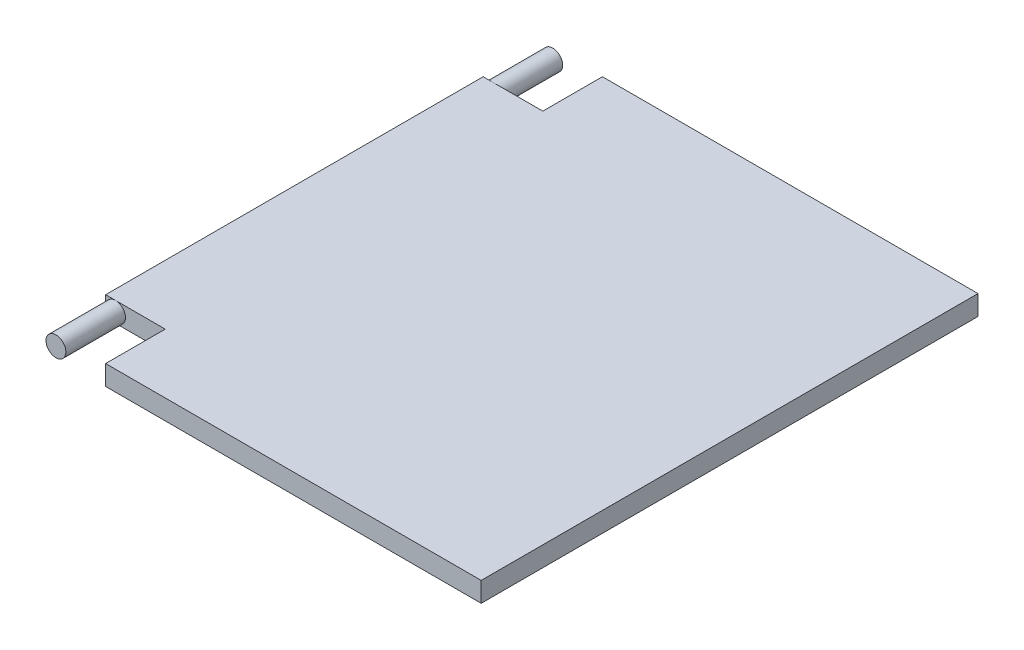
ISO-10303-21;
HEADER;
FILE_DESCRIPTION(('STEP AP214'),'2;1');
FILE_NAME('part.step','',(''),(''),'','','');
FILE_SCHEMA(('AUTOMOTIVE_DESIGN { 1 0 10303 214 1 1 1 1 }'));
ENDSEC;
DATA;
#1=APPLICATION_CONTEXT('core data for automotive mechanical design processes');
#2=APPLICATION_PROTOCOL_DEFINITION('international standard','automotive_design',2000,#1);
#3=PRODUCT_CONTEXT('',#1,'mechanical');
#4=PRODUCT('Part','Part','',(#3));
#5=PRODUCT_RELATED_PRODUCT_CATEGORY('part','',(#4));
#6=PRODUCT_DEFINITION_FORMATION('','',#4);
#7=PRODUCT_DEFINITION_CONTEXT('part definition',#1,'design');
#8=PRODUCT_DEFINITION('design','',#6,#7);
#9=PRODUCT_DEFINITION_SHAPE('','',#8);
#10=(LENGTH_UNIT() NAMED_UNIT(*) SI_UNIT(.MILLI.,.METRE.));
#11=(NAMED_UNIT(*) PLANE_ANGLE_UNIT() SI_UNIT($,.RADIAN.));
#12=(NAMED_UNIT(*) SI_UNIT($,.STERADIAN.) SOLID_ANGLE_UNIT());
#13=UNCERTAINTY_MEASURE_WITH_UNIT(LENGTH_MEASURE(1.E-05),#10,'distance_accuracy_value','');
#14=(GEOMETRIC_REPRESENTATION_CONTEXT(3) GLOBAL_UNCERTAINTY_ASSIGNED_CONTEXT((#13)) GLOBAL_UNIT_ASSIGNED_CONTEXT((#10,
#11,#12)) REPRESENTATION_CONTEXT('',''));
#15=CARTESIAN_POINT('',(0.,0.,0.));
#16=DIRECTION('',(0.,0.,1.));
#17=DIRECTION('',(1.,0.,0.));
#18=AXIS2_PLACEMENT_3D('',#15,#16,#17);
#19=CARTESIAN_POINT('',(0.,10.,-220.));
#20=DIRECTION('',(0.,0.,1.));
#21=DIRECTION('',(1.,0.,0.));
#22=AXIS2_PLACEMENT_3D('',#19,#20,#21);
#23=PLANE('',#22);
#24=CARTESIAN_POINT('',(-25.,5.,-220.));
#25=DIRECTION('',(0.,0.,-1.));
#26=DIRECTION('',(-1.,0.,0.));
#27=AXIS2_PLACEMENT_3D('',#24,#25,#26);
#28=CIRCLE('',#27,5.);
#29=CARTESIAN_POINT('',(-25.,0.,-220.));
#30=VERTEX_POINT('',#29);
#31=CARTESIAN_POINT('',(-30.,5.,-220.));
#32=VERTEX_POINT('',#31);
#33=EDGE_CURVE('E137',#30,#32,#28,.T.);
#34=ORIENTED_EDGE('',*,*,#33,.F.);
#35=DIRECTION('',(-1.,0.,0.));
#36=VECTOR('',#35,1.);
#37=CARTESIAN_POINT('',(0.,0.,-220.));
#38=LINE('',#37,#36);
#39=CARTESIAN_POINT('',(-30.,0.,-220.));
#40=VERTEX_POINT('',#39);
#41=EDGE_CURVE('E125',#30,#40,#38,.T.);
#42=ORIENTED_EDGE('',*,*,#41,.T.);
#43=DIRECTION('',(0.,-1.,0.));
#44=VECTOR('',#43,1.);
#45=CARTESIAN_POINT('',(-30.,10.,-220.));
#46=LINE('',#45,#44);
#47=EDGE_CURVE('E138',#32,#40,#46,.T.);
#48=ORIENTED_EDGE('',*,*,#47,.F.);
#49=EDGE_LOOP('',(#34,#42,#48));
#50=FACE_BOUND('',#49,.T.);
#51=ADVANCED_FACE('F33',(#50),#23,.F.);
#52=CARTESIAN_POINT('',(-25.,10.,-220.));
#53=VERTEX_POINT('',#52);
#54=EDGE_CURVE('E48',#32,#53,#28,.T.);
#55=ORIENTED_EDGE('',*,*,#54,.F.);
#56=CARTESIAN_POINT('',(-30.,10.,-220.));
#57=VERTEX_POINT('',#56);
#58=EDGE_CURVE('E196',#57,#32,#46,.T.);
#59=ORIENTED_EDGE('',*,*,#58,.F.);
#60=DIRECTION('',(-1.,0.,0.));
#61=VECTOR('',#60,1.);
#62=CARTESIAN_POINT('',(0.,10.,-220.));
#63=LINE('',#62,#61);
#64=EDGE_CURVE('E167',#53,#57,#63,.T.);
#65=ORIENTED_EDGE('',*,*,#64,.F.);
#66=EDGE_LOOP('',(#55,#59,#65));
#67=FACE_BOUND('',#66,.T.);
#68=ADVANCED_FACE('F253',(#67),#23,.F.);
#69=CARTESIAN_POINT('',(-30.,10.,-30.));
#70=DIRECTION('',(0.,0.,-1.));
#71=DIRECTION('',(-1.,0.,0.));
#72=AXIS2_PLACEMENT_3D('',#69,#70,#71);
#73=PLANE('',#72);
#74=CARTESIAN_POINT('',(-25.,5.,-30.));
#75=DIRECTION('',(0.,0.,1.));
#76=DIRECTION('',(1.,0.,0.));
#77=AXIS2_PLACEMENT_3D('',#74,#75,#76);
#78=CIRCLE('',#77,5.);
#79=CARTESIAN_POINT('',(-30.,5.,-30.));
#80=VERTEX_POINT('',#79);
#81=CARTESIAN_POINT('',(-25.,0.,-30.));
#82=VERTEX_POINT('',#81);
#83=EDGE_CURVE('E153',#80,#82,#78,.T.);
#84=ORIENTED_EDGE('',*,*,#83,.F.);
#85=DIRECTION('',(0.,-1.,0.));
#86=VECTOR('',#85,1.);
#87=CARTESIAN_POINT('',(-30.,10.,-30.));
#88=LINE('',#87,#86);
#89=CARTESIAN_POINT('',(-30.,0.,-30.));
#90=VERTEX_POINT('',#89);
#91=EDGE_CURVE('E193',#80,#90,#88,.T.);
#92=ORIENTED_EDGE('',*,*,#91,.T.);
#93=DIRECTION('',(1.,0.,0.));
#94=VECTOR('',#93,1.);
#95=CARTESIAN_POINT('',(-30.,0.,-30.));
#96=LINE('',#95,#94);
#97=EDGE_CURVE('E159',#90,#82,#96,.T.);
#98=ORIENTED_EDGE('',*,*,#97,.T.);
#99=EDGE_LOOP('',(#84,#92,#98));
#100=FACE_BOUND('',#99,.T.);
#101=ADVANCED_FACE('F232',(#100),#73,.F.);
#102=CARTESIAN_POINT('',(-25.,10.,-30.));
#103=VERTEX_POINT('',#102);
#104=EDGE_CURVE('E154',#82,#103,#78,.T.);
#105=ORIENTED_EDGE('',*,*,#104,.F.);
#106=CARTESIAN_POINT('',(0.,0.,-30.));
#107=VERTEX_POINT('',#106);
#108=EDGE_CURVE('E188',#82,#107,#96,.T.);
#109=ORIENTED_EDGE('',*,*,#108,.T.);
#110=DIRECTION('',(0.,-1.,0.));
#111=VECTOR('',#110,1.);
#112=CARTESIAN_POINT('',(0.,10.,-30.));
#113=LINE('',#112,#111);
#114=CARTESIAN_POINT('',(0.,10.,-30.));
#115=VERTEX_POINT('',#114);
#116=EDGE_CURVE('E177',#115,#107,#113,.T.);
#117=ORIENTED_EDGE('',*,*,#116,.F.);
#118=DIRECTION('',(1.,0.,0.));
#119=VECTOR('',#118,1.);
#120=CARTESIAN_POINT('',(-30.,10.,-30.));
#121=LINE('',#120,#119);
#122=EDGE_CURVE('E173',#103,#115,#121,.T.);
#123=ORIENTED_EDGE('',*,*,#122,.F.);
#124=EDGE_LOOP('',(#105,#109,#117,#123));
#125=FACE_BOUND('',#124,.T.);
#126=ADVANCED_FACE('F278',(#125),#73,.F.);
#127=CARTESIAN_POINT('',(0.,10.,-30.));
#128=DIRECTION('',(1.,0.,0.));
#129=DIRECTION('',(0.,0.,-1.));
#130=AXIS2_PLACEMENT_3D('',#127,#128,#129);
#131=PLANE('',#130);
#132=DIRECTION('',(0.,0.,1.));
#133=VECTOR('',#132,1.);
#134=CARTESIAN_POINT('',(0.,0.,-30.));
#135=LINE('',#134,#133);
#136=CARTESIAN_POINT('',(0.,0.,0.));
#137=VERTEX_POINT('',#136);
#138=EDGE_CURVE('E149',#107,#137,#135,.T.);
#139=ORIENTED_EDGE('',*,*,#138,.T.);
#140=DIRECTION('',(0.,-1.,0.));
#141=VECTOR('',#140,1.);
#142=CARTESIAN_POINT('',(0.,10.,0.));
#143=LINE('',#142,#141);
#144=CARTESIAN_POINT('',(0.,10.,0.));
#145=VERTEX_POINT('',#144);
#146=EDGE_CURVE('E11',#145,#137,#143,.T.);
#147=ORIENTED_EDGE('',*,*,#146,.F.);
#148=DIRECTION('',(0.,0.,1.));
#149=VECTOR('',#148,1.);
#150=CARTESIAN_POINT('',(0.,10.,-30.));
#151=LINE('',#150,#149);
#152=EDGE_CURVE('E155',#115,#145,#151,.T.);
#153=ORIENTED_EDGE('',*,*,#152,.F.);
#154=ORIENTED_EDGE('',*,*,#116,.T.);
#155=EDGE_LOOP('',(#139,#147,#153,#154));
#156=FACE_BOUND('',#155,.T.);
#157=ADVANCED_FACE('F35',(#156),#131,.F.);
#158=CARTESIAN_POINT('',(0.,10.,0.));
#159=DIRECTION('',(0.,0.,-1.));
#160=DIRECTION('',(-1.,0.,0.));
#161=AXIS2_PLACEMENT_3D('',#158,#159,#160);
#162=PLANE('',#161);
#163=DIRECTION('',(1.,0.,0.));
#164=VECTOR('',#163,1.);
#165=CARTESIAN_POINT('',(0.,0.,0.));
#166=LINE('',#165,#164);
#167=CARTESIAN_POINT('',(189.,0.,0.));
#168=VERTEX_POINT('',#167);
#169=EDGE_CURVE('E180',#137,#168,#166,.T.);
#170=ORIENTED_EDGE('',*,*,#169,.T.);
#171=DIRECTION('',(0.,-1.,0.));
#172=VECTOR('',#171,1.);
#173=CARTESIAN_POINT('',(189.,10.,0.));
#174=LINE('',#173,#172);
#175=CARTESIAN_POINT('',(189.,10.,0.));
#176=VERTEX_POINT('',#175);
#177=EDGE_CURVE('E41',#176,#168,#174,.T.);
#178=ORIENTED_EDGE('',*,*,#177,.F.);
#179=DIRECTION('',(1.,0.,0.));
#180=VECTOR('',#179,1.);
#181=CARTESIAN_POINT('',(0.,10.,0.));
#182=LINE('',#181,#180);
#183=EDGE_CURVE('E158',#145,#176,#182,.T.);
#184=ORIENTED_EDGE('',*,*,#183,.F.);
#185=ORIENTED_EDGE('',*,*,#146,.T.);
#186=EDGE_LOOP('',(#170,#178,#184,#185));
#187=FACE_BOUND('',#186,.T.);
#188=ADVANCED_FACE('F224',(#187),#162,.F.);
#189=CARTESIAN_POINT('',(189.,10.,0.));
#190=DIRECTION('',(-1.,0.,0.));
#191=DIRECTION('',(0.,0.,1.));
#192=AXIS2_PLACEMENT_3D('',#189,#190,#191);
#193=PLANE('',#192);
#194=DIRECTION('',(0.,0.,-1.));
#195=VECTOR('',#194,1.);
#196=CARTESIAN_POINT('',(189.,0.,0.));
#197=LINE('',#196,#195);
#198=CARTESIAN_POINT('',(189.,0.,-250.));
#199=VERTEX_POINT('',#198);
#200=EDGE_CURVE('E182',#168,#199,#197,.T.);
#201=ORIENTED_EDGE('',*,*,#200,.T.);
#202=DIRECTION('',(0.,-1.,0.));
#203=VECTOR('',#202,1.);
#204=CARTESIAN_POINT('',(189.,10.,-250.));
#205=LINE('',#204,#203);
#206=CARTESIAN_POINT('',(189.,10.,-250.));
#207=VERTEX_POINT('',#206);
#208=EDGE_CURVE('E202',#207,#199,#205,.T.);
#209=ORIENTED_EDGE('',*,*,#208,.F.);
#210=DIRECTION('',(0.,0.,-1.));
#211=VECTOR('',#210,1.);
#212=CARTESIAN_POINT('',(189.,10.,0.));
#213=LINE('',#212,#211);
#214=EDGE_CURVE('E161',#176,#207,#213,.T.);
#215=ORIENTED_EDGE('',*,*,#214,.F.);
#216=ORIENTED_EDGE('',*,*,#177,.T.);
#217=EDGE_LOOP('',(#201,#209,#215,#216));
#218=FACE_BOUND('',#217,.T.);
#219=ADVANCED_FACE('F209',(#218),#193,.F.);
#220=CARTESIAN_POINT('',(189.,10.,-250.));
#221=DIRECTION('',(0.,0.,1.));
#222=DIRECTION('',(1.,0.,0.));
#223=AXIS2_PLACEMENT_3D('',#220,#221,#222);
#224=PLANE('',#223);
#225=DIRECTION('',(-1.,0.,0.));
#226=VECTOR('',#225,1.);
#227=CARTESIAN_POINT('',(189.,0.,-250.));
#228=LINE('',#227,#226);
#229=CARTESIAN_POINT('',(-1.11022302462516E-13,0.,-250.));
#230=VERTEX_POINT('',#229);
#231=EDGE_CURVE('E184',#199,#230,#228,.T.);
#232=ORIENTED_EDGE('',*,*,#231,.T.);
#233=DIRECTION('',(0.,-1.,0.));
#234=VECTOR('',#233,1.);
#235=CARTESIAN_POINT('',(-1.11022302462516E-13,10.,-250.));
#236=LINE('',#235,#234);
#237=CARTESIAN_POINT('',(-1.11022302462516E-13,10.,-250.));
#238=VERTEX_POINT('',#237);
#239=EDGE_CURVE('E199',#238,#230,#236,.T.);
#240=ORIENTED_EDGE('',*,*,#239,.F.);
#241=DIRECTION('',(-1.,0.,0.));
#242=VECTOR('',#241,1.);
#243=CARTESIAN_POINT('',(189.,10.,-250.));
#244=LINE('',#243,#242);
#245=EDGE_CURVE('E163',#207,#238,#244,.T.);
#246=ORIENTED_EDGE('',*,*,#245,.F.);
#247=ORIENTED_EDGE('',*,*,#208,.T.);
#248=EDGE_LOOP('',(#232,#240,#246,#247));
#249=FACE_BOUND('',#248,.T.);
#250=ADVANCED_FACE('F215',(#249),#224,.F.);
#251=CARTESIAN_POINT('',(-1.11022302462516E-13,10.,-250.));
#252=DIRECTION('',(1.,0.,0.));
#253=DIRECTION('',(0.,0.,-1.));
#254=AXIS2_PLACEMENT_3D('',#251,#252,#253);
#255=PLANE('',#254);
#256=DIRECTION('',(0.,0.,1.));
#257=VECTOR('',#256,1.);
#258=CARTESIAN_POINT('',(-1.11022302462516E-13,0.,-250.));
#259=LINE('',#258,#257);
#260=CARTESIAN_POINT('',(0.,0.,-220.));
#261=VERTEX_POINT('',#260);
#262=EDGE_CURVE('E135',#230,#261,#259,.T.);
#263=ORIENTED_EDGE('',*,*,#262,.T.);
#264=DIRECTION('',(0.,-1.,0.));
#265=VECTOR('',#264,1.);
#266=CARTESIAN_POINT('',(0.,10.,-220.));
#267=LINE('',#266,#265);
#268=CARTESIAN_POINT('',(0.,10.,-220.));
#269=VERTEX_POINT('',#268);
#270=EDGE_CURVE('E121',#269,#261,#267,.T.);
#271=ORIENTED_EDGE('',*,*,#270,.F.);
#272=DIRECTION('',(0.,0.,1.));
#273=VECTOR('',#272,1.);
#274=CARTESIAN_POINT('',(-1.11022302462516E-13,10.,-250.));
#275=LINE('',#274,#273);
#276=EDGE_CURVE('E165',#238,#269,#275,.T.);
#277=ORIENTED_EDGE('',*,*,#276,.F.);
#278=ORIENTED_EDGE('',*,*,#239,.T.);
#279=EDGE_LOOP('',(#263,#271,#277,#278));
#280=FACE_BOUND('',#279,.T.);
#281=ADVANCED_FACE('F219',(#280),#255,.F.);
#282=EDGE_CURVE('E56',#53,#30,#28,.T.);
#283=ORIENTED_EDGE('',*,*,#282,.F.);
#284=EDGE_CURVE('E168',#269,#53,#63,.T.);
#285=ORIENTED_EDGE('',*,*,#284,.F.);
#286=ORIENTED_EDGE('',*,*,#270,.T.);
#287=EDGE_CURVE('E117',#261,#30,#38,.T.);
#288=ORIENTED_EDGE('',*,*,#287,.T.);
#289=EDGE_LOOP('',(#283,#285,#286,#288));
#290=FACE_BOUND('',#289,.T.);
#291=ADVANCED_FACE('F119',(#290),#23,.F.);
#292=CARTESIAN_POINT('',(-30.,10.,-220.));
#293=DIRECTION('',(1.,0.,0.));
#294=DIRECTION('',(0.,0.,-1.));
#295=AXIS2_PLACEMENT_3D('',#292,#293,#294);
#296=PLANE('',#295);
#297=DIRECTION('',(0.,0.,1.));
#298=VECTOR('',#297,1.);
#299=CARTESIAN_POINT('',(-30.,0.,-220.));
#300=LINE('',#299,#298);
#301=EDGE_CURVE('E124',#40,#90,#300,.T.);
#302=ORIENTED_EDGE('',*,*,#301,.T.);
#303=ORIENTED_EDGE('',*,*,#91,.F.);
#304=CARTESIAN_POINT('',(-30.,10.,-30.));
#305=VERTEX_POINT('',#304);
#306=EDGE_CURVE('E194',#305,#80,#88,.T.);
#307=ORIENTED_EDGE('',*,*,#306,.F.);
#308=DIRECTION('',(0.,0.,1.));
#309=VECTOR('',#308,1.);
#310=CARTESIAN_POINT('',(-30.,10.,-220.));
#311=LINE('',#310,#309);
#312=EDGE_CURVE('E171',#57,#305,#311,.T.);
#313=ORIENTED_EDGE('',*,*,#312,.F.);
#314=ORIENTED_EDGE('',*,*,#58,.T.);
#315=ORIENTED_EDGE('',*,*,#47,.T.);
#316=EDGE_LOOP('',(#302,#303,#307,#313,#314,#315));
#317=FACE_BOUND('',#316,.T.);
#318=ADVANCED_FACE('F261',(#317),#296,.F.);
#319=EDGE_CURVE('E150',#103,#80,#78,.T.);
#320=ORIENTED_EDGE('',*,*,#319,.F.);
#321=EDGE_CURVE('E174',#305,#103,#121,.T.);
#322=ORIENTED_EDGE('',*,*,#321,.F.);
#323=ORIENTED_EDGE('',*,*,#306,.T.);
#324=EDGE_LOOP('',(#320,#322,#323));
#325=FACE_BOUND('',#324,.T.);
#326=ADVANCED_FACE('F266',(#325),#73,.F.);
#327=CARTESIAN_POINT('',(0.,10.,0.));
#328=DIRECTION('',(0.,1.,0.));
#329=DIRECTION('',(0.,0.,1.));
#330=AXIS2_PLACEMENT_3D('',#327,#328,#329);
#331=PLANE('',#330);
#332=ORIENTED_EDGE('',*,*,#152,.T.);
#333=ORIENTED_EDGE('',*,*,#183,.T.);
#334=ORIENTED_EDGE('',*,*,#214,.T.);
#335=ORIENTED_EDGE('',*,*,#245,.T.);
#336=ORIENTED_EDGE('',*,*,#276,.T.);
#337=ORIENTED_EDGE('',*,*,#284,.T.);
#338=ORIENTED_EDGE('',*,*,#64,.T.);
#339=ORIENTED_EDGE('',*,*,#312,.T.);
#340=ORIENTED_EDGE('',*,*,#321,.T.);
#341=ORIENTED_EDGE('',*,*,#122,.T.);
#342=EDGE_LOOP('',(#332,#333,#334,#335,#336,#337,#338,#339,#340,#341));
#343=FACE_BOUND('',#342,.T.);
#344=ADVANCED_FACE('F221',(#343),#331,.T.);
#345=CARTESIAN_POINT('',(0.,0.,0.));
#346=DIRECTION('',(0.,1.,0.));
#347=DIRECTION('',(0.,0.,1.));
#348=AXIS2_PLACEMENT_3D('',#345,#346,#347);
#349=PLANE('',#348);
#350=ORIENTED_EDGE('',*,*,#138,.F.);
#351=ORIENTED_EDGE('',*,*,#108,.F.);
#352=ORIENTED_EDGE('',*,*,#97,.F.);
#353=ORIENTED_EDGE('',*,*,#301,.F.);
#354=ORIENTED_EDGE('',*,*,#41,.F.);
#355=ORIENTED_EDGE('',*,*,#287,.F.);
#356=ORIENTED_EDGE('',*,*,#262,.F.);
#357=ORIENTED_EDGE('',*,*,#231,.F.);
#358=ORIENTED_EDGE('',*,*,#200,.F.);
#359=ORIENTED_EDGE('',*,*,#169,.F.);
#360=EDGE_LOOP('',(#350,#351,#352,#353,#354,#355,#356,#357,#358,#359));
#361=FACE_BOUND('',#360,.T.);
#362=ADVANCED_FACE('F131',(#361),#349,.F.);
#363=CARTESIAN_POINT('',(-25.,5.,0.));
#364=DIRECTION('',(0.,0.,-1.));
#365=DIRECTION('',(-1.,0.,0.));
#366=AXIS2_PLACEMENT_3D('',#363,#364,#365);
#367=CYLINDRICAL_SURFACE('',#366,5.);
#368=CARTESIAN_POINT('',(-25.,5.,0.));
#369=DIRECTION('',(0.,0.,1.));
#370=DIRECTION('',(1.,0.,0.));
#371=AXIS2_PLACEMENT_3D('',#368,#369,#370);
#372=CIRCLE('',#371,5.);
#373=CARTESIAN_POINT('',(-20.,5.,0.));
#374=VERTEX_POINT('',#373);
#375=EDGE_CURVE('E146',#374,#374,#372,.T.);
#376=ORIENTED_EDGE('',*,*,#375,.F.);
#377=EDGE_LOOP('',(#376));
#378=FACE_BOUND('',#377,.T.);
#379=ORIENTED_EDGE('',*,*,#319,.T.);
#380=ORIENTED_EDGE('',*,*,#83,.T.);
#381=ORIENTED_EDGE('',*,*,#104,.T.);
#382=EDGE_LOOP('',(#379,#380,#381));
#383=FACE_BOUND('',#382,.T.);
#384=ADVANCED_FACE('F236',(#378,#383),#367,.T.);
#385=CARTESIAN_POINT('',(-25.,5.,0.));
#386=DIRECTION('',(0.,0.,1.));
#387=DIRECTION('',(1.,0.,0.));
#388=AXIS2_PLACEMENT_3D('',#385,#386,#387);
#389=PLANE('',#388);
#390=ORIENTED_EDGE('',*,*,#375,.T.);
#391=EDGE_LOOP('',(#390));
#392=FACE_BOUND('',#391,.T.);
#393=ADVANCED_FACE('F243',(#392),#389,.T.);
#394=CARTESIAN_POINT('',(-25.,5.,-250.));
#395=DIRECTION('',(0.,0.,1.));
#396=DIRECTION('',(1.,0.,0.));
#397=AXIS2_PLACEMENT_3D('',#394,#395,#396);
#398=CYLINDRICAL_SURFACE('',#397,5.);
#399=CARTESIAN_POINT('',(-25.,5.,-250.));
#400=DIRECTION('',(0.,0.,-1.));
#401=DIRECTION('',(-1.,0.,0.));
#402=AXIS2_PLACEMENT_3D('',#399,#400,#401);
#403=CIRCLE('',#402,5.);
#404=CARTESIAN_POINT('',(-30.,5.,-250.));
#405=VERTEX_POINT('',#404);
#406=EDGE_CURVE('E143',#405,#405,#403,.T.);
#407=ORIENTED_EDGE('',*,*,#406,.F.);
#408=EDGE_LOOP('',(#407));
#409=FACE_BOUND('',#408,.T.);
#410=ORIENTED_EDGE('',*,*,#54,.T.);
#411=ORIENTED_EDGE('',*,*,#282,.T.);
#412=ORIENTED_EDGE('',*,*,#33,.T.);
#413=EDGE_LOOP('',(#410,#411,#412));
#414=FACE_BOUND('',#413,.T.);
#415=ADVANCED_FACE('F142',(#409,#414),#398,.T.);
#416=CARTESIAN_POINT('',(-25.,5.,-250.));
#417=DIRECTION('',(0.,0.,-1.));
#418=DIRECTION('',(-1.,0.,0.));
#419=AXIS2_PLACEMENT_3D('',#416,#417,#418);
#420=PLANE('',#419);
#421=ORIENTED_EDGE('',*,*,#406,.T.);
#422=EDGE_LOOP('',(#421));
#423=FACE_BOUND('',#422,.T.);
#424=ADVANCED_FACE('F240',(#423),#420,.T.);
#425=CLOSED_SHELL('',(#51,#68,#101,#126,#157,#188,#219,#250,#281,#291,#318,#326,#344,#362,#384,
#393,#415,#424));
#426=MANIFOLD_SOLID_BREP('B2',#425);
#427=ADVANCED_BREP_SHAPE_REPRESENTATION('',(#18,#426),#14);
#428=SHAPE_DEFINITION_REPRESENTATION(#9,#427);
ENDSEC;
END-ISO-10303-21;
